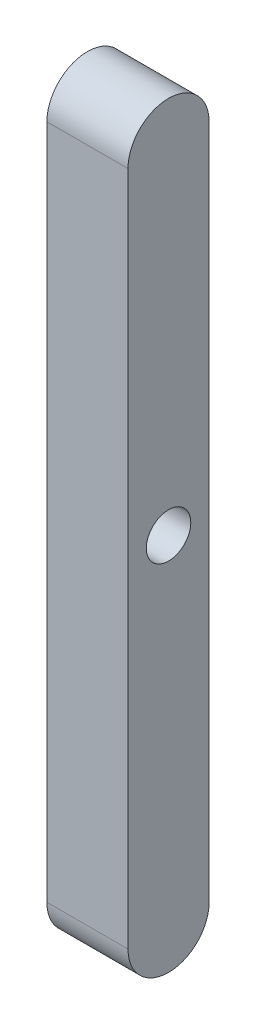
ISO-10303-21;
HEADER;
FILE_DESCRIPTION(('STEP AP214'),'2;1');
FILE_NAME('part.step','',(''),(''),'','','');
FILE_SCHEMA(('AUTOMOTIVE_DESIGN { 1 0 10303 214 1 1 1 1 }'));
ENDSEC;
DATA;
#1=APPLICATION_CONTEXT('core data for automotive mechanical design processes');
#2=APPLICATION_PROTOCOL_DEFINITION('international standard','automotive_design',2000,#1);
#3=PRODUCT_CONTEXT('',#1,'mechanical');
#4=PRODUCT('Part','Part','',(#3));
#5=PRODUCT_RELATED_PRODUCT_CATEGORY('part','',(#4));
#6=PRODUCT_DEFINITION_FORMATION('','',#4);
#7=PRODUCT_DEFINITION_CONTEXT('part definition',#1,'design');
#8=PRODUCT_DEFINITION('design','',#6,#7);
#9=PRODUCT_DEFINITION_SHAPE('','',#8);
#10=(LENGTH_UNIT() NAMED_UNIT(*) SI_UNIT(.MILLI.,.METRE.));
#11=(NAMED_UNIT(*) PLANE_ANGLE_UNIT() SI_UNIT($,.RADIAN.));
#12=(NAMED_UNIT(*) SI_UNIT($,.STERADIAN.) SOLID_ANGLE_UNIT());
#13=UNCERTAINTY_MEASURE_WITH_UNIT(LENGTH_MEASURE(1.E-05),#10,'distance_accuracy_value','');
#14=(GEOMETRIC_REPRESENTATION_CONTEXT(3) GLOBAL_UNCERTAINTY_ASSIGNED_CONTEXT((#13)) GLOBAL_UNIT_ASSIGNED_CONTEXT((#10,
#11,#12)) REPRESENTATION_CONTEXT('',''));
#15=CARTESIAN_POINT('',(0.,0.,0.));
#16=DIRECTION('',(0.,0.,1.));
#17=DIRECTION('',(1.,0.,0.));
#18=AXIS2_PLACEMENT_3D('',#15,#16,#17);
#19=CARTESIAN_POINT('',(6.,-25.,0.));
#20=DIRECTION('',(1.,0.,0.));
#21=DIRECTION('',(0.,0.,-1.));
#22=AXIS2_PLACEMENT_3D('',#19,#20,#21);
#23=PLANE('',#22);
#24=CARTESIAN_POINT('',(6.,-25.,0.));
#25=DIRECTION('',(1.,0.,0.));
#26=DIRECTION('',(0.,0.,-1.));
#27=AXIS2_PLACEMENT_3D('',#24,#25,#26);
#28=CIRCLE('',#27,3.);
#29=CARTESIAN_POINT('',(6.,-25.,3.));
#30=VERTEX_POINT('',#29);
#31=CARTESIAN_POINT('',(6.,-25.,-3.));
#32=VERTEX_POINT('',#31);
#33=EDGE_CURVE('E87',#30,#32,#28,.T.);
#34=ORIENTED_EDGE('',*,*,#33,.T.);
#35=DIRECTION('',(0.,1.,0.));
#36=VECTOR('',#35,1.);
#37=CARTESIAN_POINT('',(6.,-25.,-3.));
#38=LINE('',#37,#36);
#39=CARTESIAN_POINT('',(6.,25.,-3.));
#40=VERTEX_POINT('',#39);
#41=EDGE_CURVE('E82',#32,#40,#38,.T.);
#42=ORIENTED_EDGE('',*,*,#41,.T.);
#43=CARTESIAN_POINT('',(6.,25.,0.));
#44=DIRECTION('',(1.,0.,0.));
#45=DIRECTION('',(0.,0.,-1.));
#46=AXIS2_PLACEMENT_3D('',#43,#44,#45);
#47=CIRCLE('',#46,3.);
#48=CARTESIAN_POINT('',(6.,25.,3.00000000000001));
#49=VERTEX_POINT('',#48);
#50=EDGE_CURVE('E85',#40,#49,#47,.T.);
#51=ORIENTED_EDGE('',*,*,#50,.T.);
#52=DIRECTION('',(0.,-1.,0.));
#53=VECTOR('',#52,1.);
#54=CARTESIAN_POINT('',(6.,-25.,3.));
#55=LINE('',#54,#53);
#56=EDGE_CURVE('E52',#49,#30,#55,.T.);
#57=ORIENTED_EDGE('',*,*,#56,.T.);
#58=EDGE_LOOP('',(#34,#42,#51,#57));
#59=FACE_BOUND('',#58,.T.);
#60=CARTESIAN_POINT('',(6.,0.,0.));
#61=DIRECTION('',(1.,0.,0.));
#62=DIRECTION('',(0.,0.,-1.));
#63=AXIS2_PLACEMENT_3D('',#60,#61,#62);
#64=CIRCLE('',#63,1.6447043273331);
#65=CARTESIAN_POINT('',(6.,0.,-1.6447043273331));
#66=VERTEX_POINT('',#65);
#67=EDGE_CURVE('E102',#66,#66,#64,.T.);
#68=ORIENTED_EDGE('',*,*,#67,.F.);
#69=EDGE_LOOP('',(#68));
#70=FACE_BOUND('',#69,.T.);
#71=ADVANCED_FACE('F35',(#59,#70),#23,.T.);
#72=CARTESIAN_POINT('',(0.,-25.,0.));
#73=DIRECTION('',(1.,0.,0.));
#74=DIRECTION('',(0.,0.,-1.));
#75=AXIS2_PLACEMENT_3D('',#72,#73,#74);
#76=PLANE('',#75);
#77=CARTESIAN_POINT('',(0.,-25.,0.));
#78=DIRECTION('',(1.,0.,0.));
#79=DIRECTION('',(0.,0.,-1.));
#80=AXIS2_PLACEMENT_3D('',#77,#78,#79);
#81=CIRCLE('',#80,3.);
#82=CARTESIAN_POINT('',(0.,-25.,3.));
#83=VERTEX_POINT('',#82);
#84=CARTESIAN_POINT('',(0.,-25.,-3.));
#85=VERTEX_POINT('',#84);
#86=EDGE_CURVE('E99',#83,#85,#81,.T.);
#87=ORIENTED_EDGE('',*,*,#86,.F.);
#88=DIRECTION('',(0.,-1.,0.));
#89=VECTOR('',#88,1.);
#90=CARTESIAN_POINT('',(0.,-25.,3.));
#91=LINE('',#90,#89);
#92=CARTESIAN_POINT('',(0.,25.,3.00000000000001));
#93=VERTEX_POINT('',#92);
#94=EDGE_CURVE('E75',#93,#83,#91,.T.);
#95=ORIENTED_EDGE('',*,*,#94,.F.);
#96=CARTESIAN_POINT('',(0.,25.,0.));
#97=DIRECTION('',(1.,0.,0.));
#98=DIRECTION('',(0.,0.,-1.));
#99=AXIS2_PLACEMENT_3D('',#96,#97,#98);
#100=CIRCLE('',#99,3.);
#101=CARTESIAN_POINT('',(0.,25.,-3.));
#102=VERTEX_POINT('',#101);
#103=EDGE_CURVE('E69',#102,#93,#100,.T.);
#104=ORIENTED_EDGE('',*,*,#103,.F.);
#105=DIRECTION('',(0.,1.,0.));
#106=VECTOR('',#105,1.);
#107=CARTESIAN_POINT('',(0.,-25.,-3.));
#108=LINE('',#107,#106);
#109=EDGE_CURVE('E91',#85,#102,#108,.T.);
#110=ORIENTED_EDGE('',*,*,#109,.F.);
#111=EDGE_LOOP('',(#87,#95,#104,#110));
#112=FACE_BOUND('',#111,.T.);
#113=CARTESIAN_POINT('',(0.,0.,0.));
#114=DIRECTION('',(1.,0.,0.));
#115=DIRECTION('',(0.,0.,-1.));
#116=AXIS2_PLACEMENT_3D('',#113,#114,#115);
#117=CIRCLE('',#116,1.6447043273331);
#118=CARTESIAN_POINT('',(0.,0.,-1.6447043273331));
#119=VERTEX_POINT('',#118);
#120=EDGE_CURVE('E114',#119,#119,#117,.T.);
#121=ORIENTED_EDGE('',*,*,#120,.T.);
#122=EDGE_LOOP('',(#121));
#123=FACE_BOUND('',#122,.T.);
#124=ADVANCED_FACE('F110',(#112,#123),#76,.F.);
#125=CARTESIAN_POINT('',(6.,-25.,0.));
#126=DIRECTION('',(-1.,0.,0.));
#127=DIRECTION('',(0.,0.,1.));
#128=AXIS2_PLACEMENT_3D('',#125,#126,#127);
#129=CYLINDRICAL_SURFACE('',#128,3.);
#130=ORIENTED_EDGE('',*,*,#86,.T.);
#131=DIRECTION('',(-1.,0.,0.));
#132=VECTOR('',#131,1.);
#133=CARTESIAN_POINT('',(6.,-25.,-3.));
#134=LINE('',#133,#132);
#135=EDGE_CURVE('E11',#32,#85,#134,.T.);
#136=ORIENTED_EDGE('',*,*,#135,.F.);
#137=ORIENTED_EDGE('',*,*,#33,.F.);
#138=DIRECTION('',(-1.,0.,0.));
#139=VECTOR('',#138,1.);
#140=CARTESIAN_POINT('',(6.,-25.,3.));
#141=LINE('',#140,#139);
#142=EDGE_CURVE('E95',#30,#83,#141,.T.);
#143=ORIENTED_EDGE('',*,*,#142,.T.);
#144=EDGE_LOOP('',(#130,#136,#137,#143));
#145=FACE_BOUND('',#144,.T.);
#146=ADVANCED_FACE('F37',(#145),#129,.T.);
#147=CARTESIAN_POINT('',(6.,-25.,-3.));
#148=DIRECTION('',(0.,0.,1.));
#149=DIRECTION('',(1.,0.,0.));
#150=AXIS2_PLACEMENT_3D('',#147,#148,#149);
#151=PLANE('',#150);
#152=ORIENTED_EDGE('',*,*,#109,.T.);
#153=DIRECTION('',(-1.,0.,0.));
#154=VECTOR('',#153,1.);
#155=CARTESIAN_POINT('',(6.,25.,-3.));
#156=LINE('',#155,#154);
#157=EDGE_CURVE('E44',#40,#102,#156,.T.);
#158=ORIENTED_EDGE('',*,*,#157,.F.);
#159=ORIENTED_EDGE('',*,*,#41,.F.);
#160=ORIENTED_EDGE('',*,*,#135,.T.);
#161=EDGE_LOOP('',(#152,#158,#159,#160));
#162=FACE_BOUND('',#161,.T.);
#163=ADVANCED_FACE('F90',(#162),#151,.F.);
#164=CARTESIAN_POINT('',(6.,25.,0.));
#165=DIRECTION('',(-1.,0.,0.));
#166=DIRECTION('',(0.,0.,1.));
#167=AXIS2_PLACEMENT_3D('',#164,#165,#166);
#168=CYLINDRICAL_SURFACE('',#167,3.);
#169=ORIENTED_EDGE('',*,*,#103,.T.);
#170=DIRECTION('',(-1.,0.,0.));
#171=VECTOR('',#170,1.);
#172=CARTESIAN_POINT('',(6.,25.,3.00000000000001));
#173=LINE('',#172,#171);
#174=EDGE_CURVE('E92',#49,#93,#173,.T.);
#175=ORIENTED_EDGE('',*,*,#174,.F.);
#176=ORIENTED_EDGE('',*,*,#50,.F.);
#177=ORIENTED_EDGE('',*,*,#157,.T.);
#178=EDGE_LOOP('',(#169,#175,#176,#177));
#179=FACE_BOUND('',#178,.T.);
#180=ADVANCED_FACE('F93',(#179),#168,.T.);
#181=CARTESIAN_POINT('',(6.,-25.,3.));
#182=DIRECTION('',(0.,0.,-1.));
#183=DIRECTION('',(0.,1.,0.));
#184=AXIS2_PLACEMENT_3D('',#181,#182,#183);
#185=PLANE('',#184);
#186=ORIENTED_EDGE('',*,*,#94,.T.);
#187=ORIENTED_EDGE('',*,*,#142,.F.);
#188=ORIENTED_EDGE('',*,*,#56,.F.);
#189=ORIENTED_EDGE('',*,*,#174,.T.);
#190=EDGE_LOOP('',(#186,#187,#188,#189));
#191=FACE_BOUND('',#190,.T.);
#192=ADVANCED_FACE('F107',(#191),#185,.F.);
#193=CARTESIAN_POINT('',(6.,0.,0.));
#194=DIRECTION('',(-1.,0.,0.));
#195=DIRECTION('',(0.,0.,1.));
#196=AXIS2_PLACEMENT_3D('',#193,#194,#195);
#197=CYLINDRICAL_SURFACE('',#196,1.6447043273331);
#198=ORIENTED_EDGE('',*,*,#67,.T.);
#199=EDGE_LOOP('',(#198));
#200=FACE_BOUND('',#199,.T.);
#201=ORIENTED_EDGE('',*,*,#120,.F.);
#202=EDGE_LOOP('',(#201));
#203=FACE_BOUND('',#202,.T.);
#204=ADVANCED_FACE('F120',(#200,#203),#197,.F.);
#205=CLOSED_SHELL('',(#71,#124,#146,#163,#180,#192,#204));
#206=MANIFOLD_SOLID_BREP('B2',#205);
#207=ADVANCED_BREP_SHAPE_REPRESENTATION('',(#18,#206),#14);
#208=SHAPE_DEFINITION_REPRESENTATION(#9,#207);
ENDSEC;
END-ISO-10303-21;
